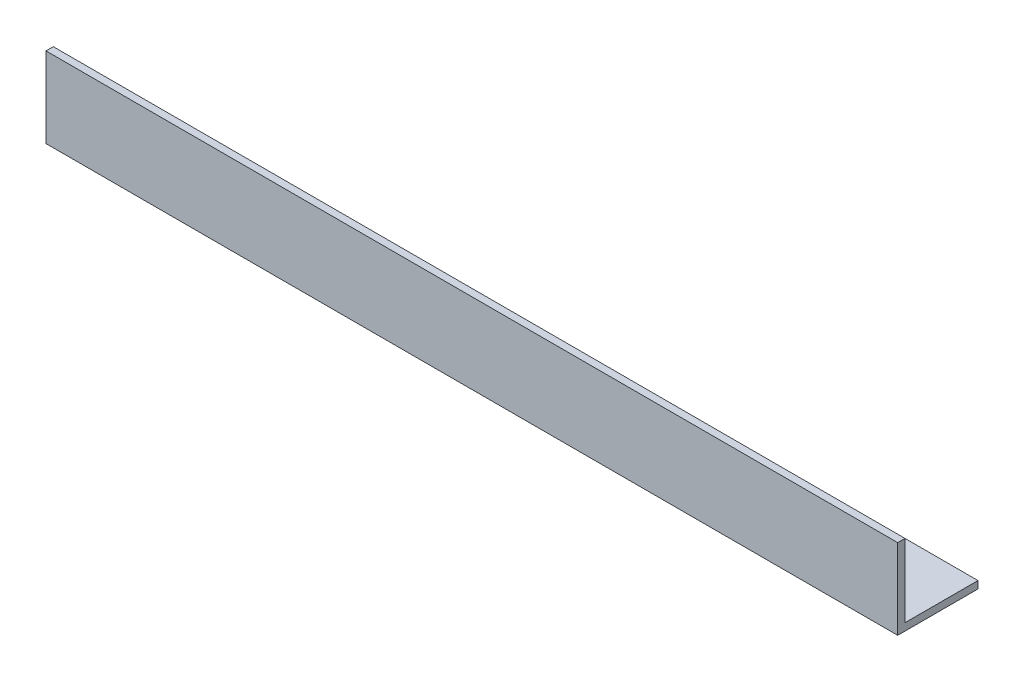
ISO-10303-21;
HEADER;
FILE_DESCRIPTION(('STEP AP214'),'2;1');
FILE_NAME('part.step','',(''),(''),'','','');
FILE_SCHEMA(('AUTOMOTIVE_DESIGN { 1 0 10303 214 1 1 1 1 }'));
ENDSEC;
DATA;
#1=APPLICATION_CONTEXT('core data for automotive mechanical design processes');
#2=APPLICATION_PROTOCOL_DEFINITION('international standard','automotive_design',2000,#1);
#3=PRODUCT_CONTEXT('',#1,'mechanical');
#4=PRODUCT('Part','Part','',(#3));
#5=PRODUCT_RELATED_PRODUCT_CATEGORY('part','',(#4));
#6=PRODUCT_DEFINITION_FORMATION('','',#4);
#7=PRODUCT_DEFINITION_CONTEXT('part definition',#1,'design');
#8=PRODUCT_DEFINITION('design','',#6,#7);
#9=PRODUCT_DEFINITION_SHAPE('','',#8);
#10=(LENGTH_UNIT() NAMED_UNIT(*) SI_UNIT(.MILLI.,.METRE.));
#11=(NAMED_UNIT(*) PLANE_ANGLE_UNIT() SI_UNIT($,.RADIAN.));
#12=(NAMED_UNIT(*) SI_UNIT($,.STERADIAN.) SOLID_ANGLE_UNIT());
#13=UNCERTAINTY_MEASURE_WITH_UNIT(LENGTH_MEASURE(1.E-05),#10,'distance_accuracy_value','');
#14=(GEOMETRIC_REPRESENTATION_CONTEXT(3) GLOBAL_UNCERTAINTY_ASSIGNED_CONTEXT((#13)) GLOBAL_UNIT_ASSIGNED_CONTEXT((#10,
#11,#12)) REPRESENTATION_CONTEXT('',''));
#15=CARTESIAN_POINT('',(0.,0.,0.));
#16=DIRECTION('',(0.,0.,1.));
#17=DIRECTION('',(1.,0.,0.));
#18=AXIS2_PLACEMENT_3D('',#15,#16,#17);
#19=CARTESIAN_POINT('',(350.,0.,0.));
#20=DIRECTION('',(0.,1.,0.));
#21=DIRECTION('',(0.,0.,1.));
#22=AXIS2_PLACEMENT_3D('',#19,#20,#21);
#23=PLANE('',#22);
#24=DIRECTION('',(0.,0.,-1.));
#25=VECTOR('',#24,1.);
#26=CARTESIAN_POINT('',(0.,0.,0.));
#27=LINE('',#26,#25);
#28=CARTESIAN_POINT('',(0.,0.,0.));
#29=VERTEX_POINT('',#28);
#30=CARTESIAN_POINT('',(0.,0.,-33.));
#31=VERTEX_POINT('',#30);
#32=EDGE_CURVE('E115',#29,#31,#27,.T.);
#33=ORIENTED_EDGE('',*,*,#32,.T.);
#34=DIRECTION('',(-1.,0.,0.));
#35=VECTOR('',#34,1.);
#36=CARTESIAN_POINT('',(350.,0.,-33.));
#37=LINE('',#36,#35);
#38=CARTESIAN_POINT('',(350.,0.,-33.));
#39=VERTEX_POINT('',#38);
#40=EDGE_CURVE('E11',#39,#31,#37,.T.);
#41=ORIENTED_EDGE('',*,*,#40,.F.);
#42=DIRECTION('',(0.,0.,-1.));
#43=VECTOR('',#42,1.);
#44=CARTESIAN_POINT('',(350.,0.,0.));
#45=LINE('',#44,#43);
#46=CARTESIAN_POINT('',(350.,0.,0.));
#47=VERTEX_POINT('',#46);
#48=EDGE_CURVE('E80',#47,#39,#45,.T.);
#49=ORIENTED_EDGE('',*,*,#48,.F.);
#50=DIRECTION('',(-1.,0.,0.));
#51=VECTOR('',#50,1.);
#52=CARTESIAN_POINT('',(350.,0.,0.));
#53=LINE('',#52,#51);
#54=EDGE_CURVE('E111',#47,#29,#53,.T.);
#55=ORIENTED_EDGE('',*,*,#54,.T.);
#56=EDGE_LOOP('',(#33,#41,#49,#55));
#57=FACE_BOUND('',#56,.T.);
#58=ADVANCED_FACE('F34',(#57),#23,.F.);
#59=CARTESIAN_POINT('',(350.,3.,-33.));
#60=DIRECTION('',(0.,0.,-1.));
#61=DIRECTION('',(-1.,0.,0.));
#62=AXIS2_PLACEMENT_3D('',#59,#60,#61);
#63=PLANE('',#62);
#64=DIRECTION('',(0.,-1.,0.));
#65=VECTOR('',#64,1.);
#66=CARTESIAN_POINT('',(0.,3.,-33.));
#67=LINE('',#66,#65);
#68=CARTESIAN_POINT('',(0.,3.,-33.));
#69=VERTEX_POINT('',#68);
#70=EDGE_CURVE('E118',#69,#31,#67,.T.);
#71=ORIENTED_EDGE('',*,*,#70,.F.);
#72=DIRECTION('',(-1.,0.,0.));
#73=VECTOR('',#72,1.);
#74=CARTESIAN_POINT('',(350.,3.,-33.));
#75=LINE('',#74,#73);
#76=CARTESIAN_POINT('',(350.,3.,-33.));
#77=VERTEX_POINT('',#76);
#78=EDGE_CURVE('E42',#77,#69,#75,.T.);
#79=ORIENTED_EDGE('',*,*,#78,.F.);
#80=DIRECTION('',(0.,-1.,0.));
#81=VECTOR('',#80,1.);
#82=CARTESIAN_POINT('',(350.,3.,-33.));
#83=LINE('',#82,#81);
#84=EDGE_CURVE('E204',#77,#39,#83,.T.);
#85=ORIENTED_EDGE('',*,*,#84,.T.);
#86=ORIENTED_EDGE('',*,*,#40,.T.);
#87=EDGE_LOOP('',(#71,#79,#85,#86));
#88=FACE_BOUND('',#87,.T.);
#89=ADVANCED_FACE('F136',(#88),#63,.T.);
#90=CARTESIAN_POINT('',(350.,3.,0.));
#91=DIRECTION('',(0.,1.,0.));
#92=DIRECTION('',(0.,0.,1.));
#93=AXIS2_PLACEMENT_3D('',#90,#91,#92);
#94=PLANE('',#93);
#95=DIRECTION('',(0.,0.,-1.));
#96=VECTOR('',#95,1.);
#97=CARTESIAN_POINT('',(0.,3.,0.));
#98=LINE('',#97,#96);
#99=CARTESIAN_POINT('',(0.,3.,-3.));
#100=VERTEX_POINT('',#99);
#101=EDGE_CURVE('E121',#100,#69,#98,.T.);
#102=ORIENTED_EDGE('',*,*,#101,.F.);
#103=DIRECTION('',(-1.,0.,0.));
#104=VECTOR('',#103,1.);
#105=CARTESIAN_POINT('',(350.,3.,-3.));
#106=LINE('',#105,#104);
#107=CARTESIAN_POINT('',(350.,3.,-3.));
#108=VERTEX_POINT('',#107);
#109=EDGE_CURVE('E101',#108,#100,#106,.T.);
#110=ORIENTED_EDGE('',*,*,#109,.F.);
#111=DIRECTION('',(0.,0.,-1.));
#112=VECTOR('',#111,1.);
#113=CARTESIAN_POINT('',(350.,3.,0.));
#114=LINE('',#113,#112);
#115=EDGE_CURVE('E107',#108,#77,#114,.T.);
#116=ORIENTED_EDGE('',*,*,#115,.T.);
#117=ORIENTED_EDGE('',*,*,#78,.T.);
#118=EDGE_LOOP('',(#102,#110,#116,#117));
#119=FACE_BOUND('',#118,.T.);
#120=ADVANCED_FACE('F133',(#119),#94,.T.);
#121=CARTESIAN_POINT('',(350.,33.,-3.));
#122=DIRECTION('',(0.,0.,-1.));
#123=DIRECTION('',(0.,1.,0.));
#124=AXIS2_PLACEMENT_3D('',#121,#122,#123);
#125=PLANE('',#124);
#126=DIRECTION('',(0.,-1.,0.));
#127=VECTOR('',#126,1.);
#128=CARTESIAN_POINT('',(0.,33.,-3.));
#129=LINE('',#128,#127);
#130=CARTESIAN_POINT('',(0.,33.,-3.));
#131=VERTEX_POINT('',#130);
#132=EDGE_CURVE('E96',#131,#100,#129,.T.);
#133=ORIENTED_EDGE('',*,*,#132,.F.);
#134=DIRECTION('',(-1.,0.,0.));
#135=VECTOR('',#134,1.);
#136=CARTESIAN_POINT('',(350.,33.,-3.));
#137=LINE('',#136,#135);
#138=CARTESIAN_POINT('',(350.,33.,-3.));
#139=VERTEX_POINT('',#138);
#140=EDGE_CURVE('E91',#139,#131,#137,.T.);
#141=ORIENTED_EDGE('',*,*,#140,.F.);
#142=DIRECTION('',(0.,-1.,0.));
#143=VECTOR('',#142,1.);
#144=CARTESIAN_POINT('',(350.,33.,-3.));
#145=LINE('',#144,#143);
#146=EDGE_CURVE('E94',#139,#108,#145,.T.);
#147=ORIENTED_EDGE('',*,*,#146,.T.);
#148=ORIENTED_EDGE('',*,*,#109,.T.);
#149=EDGE_LOOP('',(#133,#141,#147,#148));
#150=FACE_BOUND('',#149,.T.);
#151=ADVANCED_FACE('F93',(#150),#125,.T.);
#152=CARTESIAN_POINT('',(350.,33.,0.));
#153=DIRECTION('',(0.,1.,0.));
#154=DIRECTION('',(0.,0.,1.));
#155=AXIS2_PLACEMENT_3D('',#152,#153,#154);
#156=PLANE('',#155);
#157=DIRECTION('',(0.,0.,-1.));
#158=VECTOR('',#157,1.);
#159=CARTESIAN_POINT('',(0.,33.,0.));
#160=LINE('',#159,#158);
#161=CARTESIAN_POINT('',(0.,33.,0.));
#162=VERTEX_POINT('',#161);
#163=EDGE_CURVE('E125',#162,#131,#160,.T.);
#164=ORIENTED_EDGE('',*,*,#163,.F.);
#165=DIRECTION('',(-1.,0.,0.));
#166=VECTOR('',#165,1.);
#167=CARTESIAN_POINT('',(350.,33.,0.));
#168=LINE('',#167,#166);
#169=CARTESIAN_POINT('',(350.,33.,0.));
#170=VERTEX_POINT('',#169);
#171=EDGE_CURVE('E71',#170,#162,#168,.T.);
#172=ORIENTED_EDGE('',*,*,#171,.F.);
#173=DIRECTION('',(0.,0.,-1.));
#174=VECTOR('',#173,1.);
#175=CARTESIAN_POINT('',(350.,33.,0.));
#176=LINE('',#175,#174);
#177=EDGE_CURVE('E105',#170,#139,#176,.T.);
#178=ORIENTED_EDGE('',*,*,#177,.T.);
#179=ORIENTED_EDGE('',*,*,#140,.T.);
#180=EDGE_LOOP('',(#164,#172,#178,#179));
#181=FACE_BOUND('',#180,.T.);
#182=ADVANCED_FACE('F109',(#181),#156,.T.);
#183=CARTESIAN_POINT('',(350.,33.,0.));
#184=DIRECTION('',(0.,0.,-1.));
#185=DIRECTION('',(0.,1.,0.));
#186=AXIS2_PLACEMENT_3D('',#183,#184,#185);
#187=PLANE('',#186);
#188=DIRECTION('',(0.,-1.,0.));
#189=VECTOR('',#188,1.);
#190=CARTESIAN_POINT('',(0.,33.,0.));
#191=LINE('',#190,#189);
#192=EDGE_CURVE('E74',#162,#29,#191,.T.);
#193=ORIENTED_EDGE('',*,*,#192,.T.);
#194=ORIENTED_EDGE('',*,*,#54,.F.);
#195=DIRECTION('',(0.,-1.,0.));
#196=VECTOR('',#195,1.);
#197=CARTESIAN_POINT('',(350.,33.,0.));
#198=LINE('',#197,#196);
#199=EDGE_CURVE('E50',#170,#47,#198,.T.);
#200=ORIENTED_EDGE('',*,*,#199,.F.);
#201=ORIENTED_EDGE('',*,*,#171,.T.);
#202=EDGE_LOOP('',(#193,#194,#200,#201));
#203=FACE_BOUND('',#202,.T.);
#204=ADVANCED_FACE('F141',(#203),#187,.F.);
#205=CARTESIAN_POINT('',(350.,0.,0.));
#206=DIRECTION('',(-1.,0.,0.));
#207=DIRECTION('',(0.,0.,1.));
#208=AXIS2_PLACEMENT_3D('',#205,#206,#207);
#209=PLANE('',#208);
#210=ORIENTED_EDGE('',*,*,#48,.T.);
#211=ORIENTED_EDGE('',*,*,#84,.F.);
#212=ORIENTED_EDGE('',*,*,#115,.F.);
#213=ORIENTED_EDGE('',*,*,#146,.F.);
#214=ORIENTED_EDGE('',*,*,#177,.F.);
#215=ORIENTED_EDGE('',*,*,#199,.T.);
#216=EDGE_LOOP('',(#210,#211,#212,#213,#214,#215));
#217=FACE_BOUND('',#216,.T.);
#218=ADVANCED_FACE('F104',(#217),#209,.F.);
#219=CARTESIAN_POINT('',(0.,0.,0.));
#220=DIRECTION('',(-1.,0.,0.));
#221=DIRECTION('',(0.,0.,1.));
#222=AXIS2_PLACEMENT_3D('',#219,#220,#221);
#223=PLANE('',#222);
#224=ORIENTED_EDGE('',*,*,#32,.F.);
#225=ORIENTED_EDGE('',*,*,#192,.F.);
#226=ORIENTED_EDGE('',*,*,#163,.T.);
#227=ORIENTED_EDGE('',*,*,#132,.T.);
#228=ORIENTED_EDGE('',*,*,#101,.T.);
#229=ORIENTED_EDGE('',*,*,#70,.T.);
#230=EDGE_LOOP('',(#224,#225,#226,#227,#228,#229));
#231=FACE_BOUND('',#230,.T.);
#232=ADVANCED_FACE('F139',(#231),#223,.T.);
#233=CLOSED_SHELL('',(#58,#89,#120,#151,#182,#204,#218,#232));
#234=MANIFOLD_SOLID_BREP('B2',#233);
#235=ADVANCED_BREP_SHAPE_REPRESENTATION('',(#18,#234),#14);
#236=SHAPE_DEFINITION_REPRESENTATION(#9,#235);
ENDSEC;
END-ISO-10303-21;
